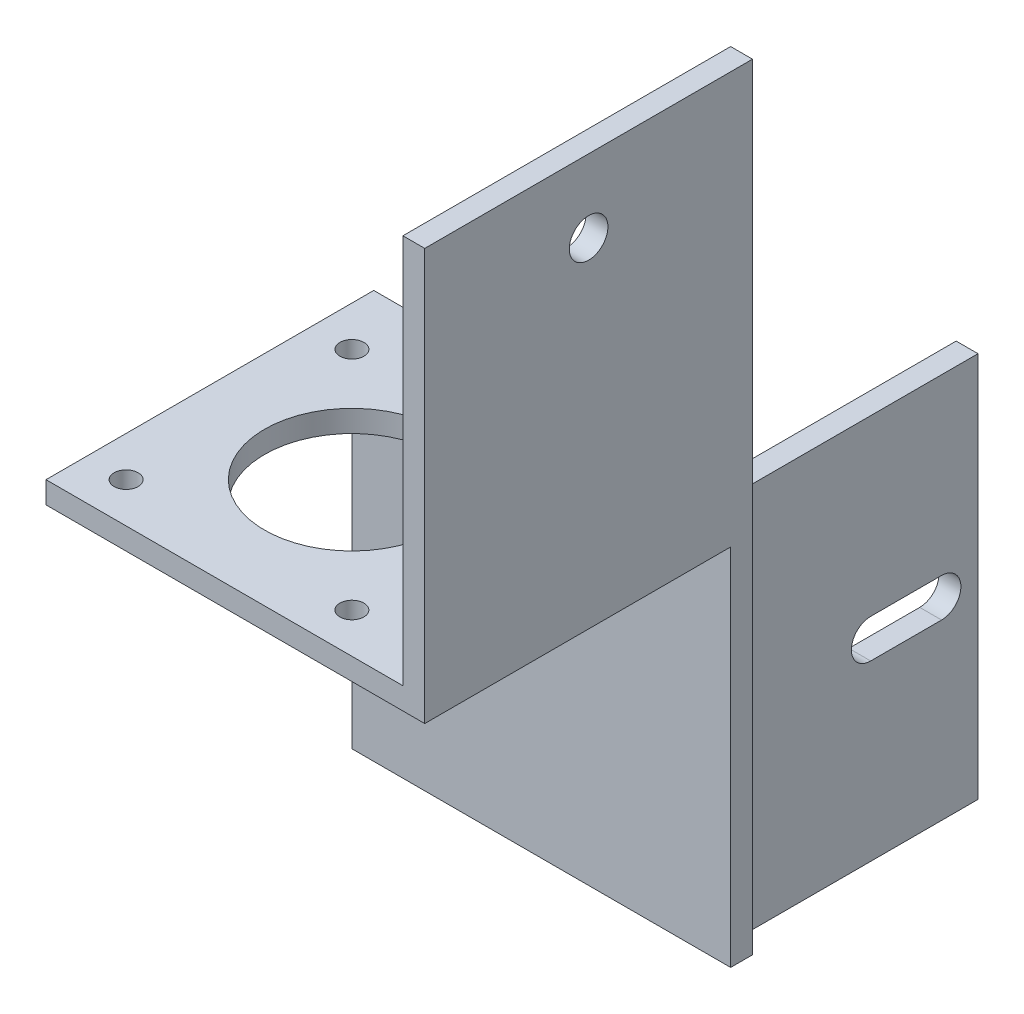
ISO-10303-21;
HEADER;
FILE_DESCRIPTION(('STEP AP214'),'2;1');
FILE_NAME('part.step','',(''),(''),'','','');
FILE_SCHEMA(('AUTOMOTIVE_DESIGN { 1 0 10303 214 1 1 1 1 }'));
ENDSEC;
DATA;
#1=APPLICATION_CONTEXT('core data for automotive mechanical design processes');
#2=APPLICATION_PROTOCOL_DEFINITION('international standard','automotive_design',2000,#1);
#3=PRODUCT_CONTEXT('',#1,'mechanical');
#4=PRODUCT('Part','Part','',(#3));
#5=PRODUCT_RELATED_PRODUCT_CATEGORY('part','',(#4));
#6=PRODUCT_DEFINITION_FORMATION('','',#4);
#7=PRODUCT_DEFINITION_CONTEXT('part definition',#1,'design');
#8=PRODUCT_DEFINITION('design','',#6,#7);
#9=PRODUCT_DEFINITION_SHAPE('','',#8);
#10=(LENGTH_UNIT() NAMED_UNIT(*) SI_UNIT(.MILLI.,.METRE.));
#11=(NAMED_UNIT(*) PLANE_ANGLE_UNIT() SI_UNIT($,.RADIAN.));
#12=(NAMED_UNIT(*) SI_UNIT($,.STERADIAN.) SOLID_ANGLE_UNIT());
#13=UNCERTAINTY_MEASURE_WITH_UNIT(LENGTH_MEASURE(1.E-05),#10,'distance_accuracy_value','');
#14=(GEOMETRIC_REPRESENTATION_CONTEXT(3) GLOBAL_UNCERTAINTY_ASSIGNED_CONTEXT((#13)) GLOBAL_UNIT_ASSIGNED_CONTEXT((#10,
#11,#12)) REPRESENTATION_CONTEXT('',''));
#15=CARTESIAN_POINT('',(0.,0.,0.));
#16=DIRECTION('',(0.,0.,1.));
#17=DIRECTION('',(1.,0.,0.));
#18=AXIS2_PLACEMENT_3D('',#15,#16,#17);
#19=CARTESIAN_POINT('',(0.,0.,0.));
#20=DIRECTION('',(0.,0.,1.));
#21=DIRECTION('',(1.,0.,0.));
#22=AXIS2_PLACEMENT_3D('',#19,#20,#21);
#23=PLANE('',#22);
#24=DIRECTION('',(0.,-1.,0.));
#25=VECTOR('',#24,1.);
#26=CARTESIAN_POINT('',(30.8060344827586,-41.6400862068965,0.));
#27=LINE('',#26,#25);
#28=CARTESIAN_POINT('',(30.8060344827586,11.3599137931034,0.));
#29=VERTEX_POINT('',#28);
#30=CARTESIAN_POINT('',(30.8060344827586,-41.6400862068965,0.));
#31=VERTEX_POINT('',#30);
#32=EDGE_CURVE('E175',#29,#31,#27,.T.);
#33=ORIENTED_EDGE('',*,*,#32,.F.);
#34=DIRECTION('',(0.,-1.,0.));
#35=VECTOR('',#34,1.);
#36=CARTESIAN_POINT('',(30.8060344827586,64.8599137931034,0.));
#37=LINE('',#36,#35);
#38=CARTESIAN_POINT('',(30.8060344827586,64.8599137931034,0.));
#39=VERTEX_POINT('',#38);
#40=EDGE_CURVE('E224',#39,#29,#37,.T.);
#41=ORIENTED_EDGE('',*,*,#40,.F.);
#42=DIRECTION('',(-1.,0.,0.));
#43=VECTOR('',#42,1.);
#44=CARTESIAN_POINT('',(33.8060344827586,64.8599137931034,0.));
#45=LINE('',#44,#43);
#46=CARTESIAN_POINT('',(33.8060344827586,64.8599137931034,0.));
#47=VERTEX_POINT('',#46);
#48=EDGE_CURVE('E211',#47,#39,#45,.T.);
#49=ORIENTED_EDGE('',*,*,#48,.F.);
#50=DIRECTION('',(0.,1.,0.));
#51=VECTOR('',#50,1.);
#52=CARTESIAN_POINT('',(33.8060344827586,-41.6400862068965,0.));
#53=LINE('',#52,#51);
#54=CARTESIAN_POINT('',(33.8060344827586,-41.6400862068965,0.));
#55=VERTEX_POINT('',#54);
#56=EDGE_CURVE('E239',#55,#47,#53,.T.);
#57=ORIENTED_EDGE('',*,*,#56,.F.);
#58=DIRECTION('',(1.,0.,0.));
#59=VECTOR('',#58,1.);
#60=CARTESIAN_POINT('',(-18.1939655172414,-41.6400862068965,0.));
#61=LINE('',#60,#59);
#62=EDGE_CURVE('E292',#31,#55,#61,.T.);
#63=ORIENTED_EDGE('',*,*,#62,.F.);
#64=EDGE_LOOP('',(#33,#41,#49,#57,#63));
#65=FACE_BOUND('',#64,.T.);
#66=ADVANCED_FACE('F39',(#65),#23,.F.);
#67=DIRECTION('',(0.,1.,0.));
#68=VECTOR('',#67,1.);
#69=CARTESIAN_POINT('',(27.8060344827586,-41.6400862068965,0.));
#70=LINE('',#69,#68);
#71=CARTESIAN_POINT('',(27.8060344827586,-41.6400862068965,0.));
#72=VERTEX_POINT('',#71);
#73=CARTESIAN_POINT('',(27.8060344827586,11.3599137931034,0.));
#74=VERTEX_POINT('',#73);
#75=EDGE_CURVE('E182',#72,#74,#70,.T.);
#76=ORIENTED_EDGE('',*,*,#75,.F.);
#77=CARTESIAN_POINT('',(-18.1939655172414,-41.6400862068965,0.));
#78=VERTEX_POINT('',#77);
#79=EDGE_CURVE('E293',#78,#72,#61,.T.);
#80=ORIENTED_EDGE('',*,*,#79,.F.);
#81=DIRECTION('',(0.,-1.,0.));
#82=VECTOR('',#81,1.);
#83=CARTESIAN_POINT('',(-18.1939655172414,11.3599137931034,0.));
#84=LINE('',#83,#82);
#85=CARTESIAN_POINT('',(-18.1939655172414,11.3599137931034,0.));
#86=VERTEX_POINT('',#85);
#87=EDGE_CURVE('E283',#86,#78,#84,.T.);
#88=ORIENTED_EDGE('',*,*,#87,.F.);
#89=DIRECTION('',(-1.,0.,0.));
#90=VECTOR('',#89,1.);
#91=CARTESIAN_POINT('',(-18.1939655172414,11.3599137931034,0.));
#92=LINE('',#91,#90);
#93=EDGE_CURVE('E287',#74,#86,#92,.T.);
#94=ORIENTED_EDGE('',*,*,#93,.F.);
#95=EDGE_LOOP('',(#76,#80,#88,#94));
#96=FACE_BOUND('',#95,.T.);
#97=ADVANCED_FACE('F327',(#96),#23,.F.);
#98=CARTESIAN_POINT('',(-18.1939655172414,11.3599137931034,3.));
#99=DIRECTION('',(0.,-1.,0.));
#100=DIRECTION('',(0.,0.,-1.));
#101=AXIS2_PLACEMENT_3D('',#98,#99,#100);
#102=PLANE('',#101);
#103=CARTESIAN_POINT('',(2.80603448275863,11.3599137931034,24.));
#104=DIRECTION('',(0.,-1.,0.));
#105=DIRECTION('',(0.,0.,-1.));
#106=AXIS2_PLACEMENT_3D('',#103,#104,#105);
#107=CIRCLE('',#106,12.);
#108=CARTESIAN_POINT('',(2.80603448275863,11.3599137931034,12.));
#109=VERTEX_POINT('',#108);
#110=EDGE_CURVE('E266',#109,#109,#107,.T.);
#111=ORIENTED_EDGE('',*,*,#110,.T.);
#112=EDGE_LOOP('',(#111));
#113=FACE_BOUND('',#112,.T.);
#114=CARTESIAN_POINT('',(18.3060344827586,11.3599137931034,39.5));
#115=DIRECTION('',(0.,-1.,0.));
#116=DIRECTION('',(0.,0.,-1.));
#117=AXIS2_PLACEMENT_3D('',#114,#115,#116);
#118=CIRCLE('',#117,1.65);
#119=CARTESIAN_POINT('',(18.3060344827586,11.3599137931034,37.85));
#120=VERTEX_POINT('',#119);
#121=EDGE_CURVE('E242',#120,#120,#118,.T.);
#122=ORIENTED_EDGE('',*,*,#121,.T.);
#123=EDGE_LOOP('',(#122));
#124=FACE_BOUND('',#123,.T.);
#125=CARTESIAN_POINT('',(18.306034482759,11.3599137931034,8.49999999999994));
#126=DIRECTION('',(0.,-1.,0.));
#127=DIRECTION('',(0.,0.,-1.));
#128=AXIS2_PLACEMENT_3D('',#125,#126,#127);
#129=CIRCLE('',#128,1.65);
#130=CARTESIAN_POINT('',(18.306034482759,11.3599137931034,6.84999999999995));
#131=VERTEX_POINT('',#130);
#132=EDGE_CURVE('E249',#131,#131,#129,.T.);
#133=ORIENTED_EDGE('',*,*,#132,.T.);
#134=EDGE_LOOP('',(#133));
#135=FACE_BOUND('',#134,.T.);
#136=CARTESIAN_POINT('',(-12.6939655172411,11.3599137931034,8.49999999999968));
#137=DIRECTION('',(0.,-1.,0.));
#138=DIRECTION('',(0.,0.,-1.));
#139=AXIS2_PLACEMENT_3D('',#136,#137,#138);
#140=CIRCLE('',#139,1.64999999999999);
#141=CARTESIAN_POINT('',(-12.6939655172411,11.3599137931034,6.84999999999969));
#142=VERTEX_POINT('',#141);
#143=EDGE_CURVE('E255',#142,#142,#140,.T.);
#144=ORIENTED_EDGE('',*,*,#143,.T.);
#145=EDGE_LOOP('',(#144));
#146=FACE_BOUND('',#145,.T.);
#147=CARTESIAN_POINT('',(-12.6939655172412,11.3599137931034,39.4999999999997));
#148=DIRECTION('',(0.,-1.,0.));
#149=DIRECTION('',(0.,0.,-1.));
#150=AXIS2_PLACEMENT_3D('',#147,#148,#149);
#151=CIRCLE('',#150,1.65);
#152=CARTESIAN_POINT('',(-12.6939655172412,11.3599137931034,37.8499999999997));
#153=VERTEX_POINT('',#152);
#154=EDGE_CURVE('E261',#153,#153,#151,.T.);
#155=ORIENTED_EDGE('',*,*,#154,.T.);
#156=EDGE_LOOP('',(#155));
#157=FACE_BOUND('',#156,.T.);
#158=DIRECTION('',(0.,0.,1.));
#159=VECTOR('',#158,1.);
#160=CARTESIAN_POINT('',(30.8060344827586,11.3599137931034,0.));
#161=LINE('',#160,#159);
#162=CARTESIAN_POINT('',(30.8060344827586,11.3599137931034,45.));
#163=VERTEX_POINT('',#162);
#164=EDGE_CURVE('E212',#29,#163,#161,.T.);
#165=ORIENTED_EDGE('',*,*,#164,.F.);
#166=DIRECTION('',(0.,0.,1.));
#167=VECTOR('',#166,1.);
#168=CARTESIAN_POINT('',(30.8060344827586,11.3599137931034,-33.96));
#169=LINE('',#168,#167);
#170=CARTESIAN_POINT('',(30.8060344827586,11.3599137931034,-33.96));
#171=VERTEX_POINT('',#170);
#172=EDGE_CURVE('E188',#171,#29,#169,.T.);
#173=ORIENTED_EDGE('',*,*,#172,.F.);
#174=DIRECTION('',(1.,0.,0.));
#175=VECTOR('',#174,1.);
#176=CARTESIAN_POINT('',(30.8060344827586,11.3599137931034,-33.96));
#177=LINE('',#176,#175);
#178=CARTESIAN_POINT('',(27.8060344827586,11.3599137931034,-33.96));
#179=VERTEX_POINT('',#178);
#180=EDGE_CURVE('E186',#179,#171,#177,.T.);
#181=ORIENTED_EDGE('',*,*,#180,.F.);
#182=DIRECTION('',(0.,0.,1.));
#183=VECTOR('',#182,1.);
#184=CARTESIAN_POINT('',(27.8060344827586,11.3599137931034,-33.96));
#185=LINE('',#184,#183);
#186=EDGE_CURVE('E195',#179,#74,#185,.T.);
#187=ORIENTED_EDGE('',*,*,#186,.T.);
#188=ORIENTED_EDGE('',*,*,#93,.T.);
#189=DIRECTION('',(0.,0.,-1.));
#190=VECTOR('',#189,1.);
#191=CARTESIAN_POINT('',(-18.1939655172414,11.3599137931034,3.));
#192=LINE('',#191,#190);
#193=CARTESIAN_POINT('',(-18.1939655172414,11.3599137931034,45.));
#194=VERTEX_POINT('',#193);
#195=EDGE_CURVE('E289',#194,#86,#192,.T.);
#196=ORIENTED_EDGE('',*,*,#195,.F.);
#197=DIRECTION('',(-1.,0.,0.));
#198=VECTOR('',#197,1.);
#199=CARTESIAN_POINT('',(-18.1939655172414,11.3599137931034,45.));
#200=LINE('',#199,#198);
#201=EDGE_CURVE('E277',#163,#194,#200,.T.);
#202=ORIENTED_EDGE('',*,*,#201,.F.);
#203=EDGE_LOOP('',(#165,#173,#181,#187,#188,#196,#202));
#204=FACE_BOUND('',#203,.T.);
#205=ADVANCED_FACE('F334',(#113,#124,#135,#146,#157,#204),#102,.F.);
#206=CARTESIAN_POINT('',(-18.1939655172414,11.3599137931034,3.));
#207=DIRECTION('',(1.,0.,0.));
#208=DIRECTION('',(0.,1.,0.));
#209=AXIS2_PLACEMENT_3D('',#206,#207,#208);
#210=PLANE('',#209);
#211=ORIENTED_EDGE('',*,*,#87,.T.);
#212=DIRECTION('',(0.,0.,-1.));
#213=VECTOR('',#212,1.);
#214=CARTESIAN_POINT('',(-18.1939655172414,-41.6400862068965,3.));
#215=LINE('',#214,#213);
#216=CARTESIAN_POINT('',(-18.1939655172414,-41.6400862068965,3.));
#217=VERTEX_POINT('',#216);
#218=EDGE_CURVE('E299',#217,#78,#215,.T.);
#219=ORIENTED_EDGE('',*,*,#218,.F.);
#220=DIRECTION('',(0.,-1.,0.));
#221=VECTOR('',#220,1.);
#222=CARTESIAN_POINT('',(-18.1939655172414,11.3599137931034,3.));
#223=LINE('',#222,#221);
#224=CARTESIAN_POINT('',(-18.1939655172414,8.35991379310345,3.));
#225=VERTEX_POINT('',#224);
#226=EDGE_CURVE('E284',#225,#217,#223,.T.);
#227=ORIENTED_EDGE('',*,*,#226,.F.);
#228=DIRECTION('',(0.,0.,-1.));
#229=VECTOR('',#228,1.);
#230=CARTESIAN_POINT('',(-18.1939655172414,8.35991379310345,45.));
#231=LINE('',#230,#229);
#232=CARTESIAN_POINT('',(-18.1939655172414,8.35991379310345,45.));
#233=VERTEX_POINT('',#232);
#234=EDGE_CURVE('E279',#233,#225,#231,.T.);
#235=ORIENTED_EDGE('',*,*,#234,.F.);
#236=DIRECTION('',(0.,-1.,0.));
#237=VECTOR('',#236,1.);
#238=CARTESIAN_POINT('',(-18.1939655172414,11.3599137931034,45.));
#239=LINE('',#238,#237);
#240=EDGE_CURVE('E272',#194,#233,#239,.T.);
#241=ORIENTED_EDGE('',*,*,#240,.F.);
#242=ORIENTED_EDGE('',*,*,#195,.T.);
#243=EDGE_LOOP('',(#211,#219,#227,#235,#241,#242));
#244=FACE_BOUND('',#243,.T.);
#245=ADVANCED_FACE('F41',(#244),#210,.F.);
#246=CARTESIAN_POINT('',(-18.1939655172414,-41.6400862068965,3.));
#247=DIRECTION('',(0.,1.,0.));
#248=DIRECTION('',(0.,0.,1.));
#249=AXIS2_PLACEMENT_3D('',#246,#247,#248);
#250=PLANE('',#249);
#251=ORIENTED_EDGE('',*,*,#79,.T.);
#252=DIRECTION('',(0.,0.,1.));
#253=VECTOR('',#252,1.);
#254=CARTESIAN_POINT('',(27.8060344827586,-41.6400862068965,-33.96));
#255=LINE('',#254,#253);
#256=CARTESIAN_POINT('',(27.8060344827586,-41.6400862068965,-33.96));
#257=VERTEX_POINT('',#256);
#258=EDGE_CURVE('E198',#257,#72,#255,.T.);
#259=ORIENTED_EDGE('',*,*,#258,.F.);
#260=DIRECTION('',(-1.,0.,0.));
#261=VECTOR('',#260,1.);
#262=CARTESIAN_POINT('',(30.8060344827586,-41.6400862068965,-33.96));
#263=LINE('',#262,#261);
#264=CARTESIAN_POINT('',(30.8060344827586,-41.6400862068965,-33.96));
#265=VERTEX_POINT('',#264);
#266=EDGE_CURVE('E181',#265,#257,#263,.T.);
#267=ORIENTED_EDGE('',*,*,#266,.F.);
#268=DIRECTION('',(0.,0.,1.));
#269=VECTOR('',#268,1.);
#270=CARTESIAN_POINT('',(30.8060344827586,-41.6400862068965,-33.96));
#271=LINE('',#270,#269);
#272=EDGE_CURVE('E201',#265,#31,#271,.T.);
#273=ORIENTED_EDGE('',*,*,#272,.T.);
#274=ORIENTED_EDGE('',*,*,#62,.T.);
#275=DIRECTION('',(0.,0.,-1.));
#276=VECTOR('',#275,1.);
#277=CARTESIAN_POINT('',(33.8060344827586,-41.6400862068965,0.));
#278=LINE('',#277,#276);
#279=CARTESIAN_POINT('',(33.8060344827586,-41.6400862068965,3.));
#280=VERTEX_POINT('',#279);
#281=EDGE_CURVE('E236',#280,#55,#278,.T.);
#282=ORIENTED_EDGE('',*,*,#281,.F.);
#283=DIRECTION('',(1.,0.,0.));
#284=VECTOR('',#283,1.);
#285=CARTESIAN_POINT('',(-18.1939655172414,-41.6400862068965,3.));
#286=LINE('',#285,#284);
#287=EDGE_CURVE('E286',#217,#280,#286,.T.);
#288=ORIENTED_EDGE('',*,*,#287,.F.);
#289=ORIENTED_EDGE('',*,*,#218,.T.);
#290=EDGE_LOOP('',(#251,#259,#267,#273,#274,#282,#288,#289));
#291=FACE_BOUND('',#290,.T.);
#292=ADVANCED_FACE('F342',(#291),#250,.F.);
#293=CARTESIAN_POINT('',(0.,0.,3.));
#294=DIRECTION('',(0.,0.,1.));
#295=DIRECTION('',(1.,0.,0.));
#296=AXIS2_PLACEMENT_3D('',#293,#294,#295);
#297=PLANE('',#296);
#298=DIRECTION('',(1.,0.,0.));
#299=VECTOR('',#298,1.);
#300=CARTESIAN_POINT('',(-18.1939655172414,8.35991379310345,3.));
#301=LINE('',#300,#299);
#302=CARTESIAN_POINT('',(33.8060344827586,8.35991379310345,3.));
#303=VERTEX_POINT('',#302);
#304=EDGE_CURVE('E269',#225,#303,#301,.T.);
#305=ORIENTED_EDGE('',*,*,#304,.F.);
#306=ORIENTED_EDGE('',*,*,#226,.T.);
#307=ORIENTED_EDGE('',*,*,#287,.T.);
#308=DIRECTION('',(0.,-1.,0.));
#309=VECTOR('',#308,1.);
#310=CARTESIAN_POINT('',(33.8060344827586,-41.6400862068965,3.));
#311=LINE('',#310,#309);
#312=EDGE_CURVE('E233',#303,#280,#311,.T.);
#313=ORIENTED_EDGE('',*,*,#312,.F.);
#314=EDGE_LOOP('',(#305,#306,#307,#313));
#315=FACE_BOUND('',#314,.T.);
#316=ADVANCED_FACE('F338',(#315),#297,.T.);
#317=CARTESIAN_POINT('',(-18.1939655172414,8.35991379310345,45.));
#318=DIRECTION('',(0.,1.,0.));
#319=DIRECTION('',(0.,0.,1.));
#320=AXIS2_PLACEMENT_3D('',#317,#318,#319);
#321=PLANE('',#320);
#322=CARTESIAN_POINT('',(-12.6939655172412,8.35991379310345,39.4999999999997));
#323=DIRECTION('',(0.,-1.,0.));
#324=DIRECTION('',(0.,0.,-1.));
#325=AXIS2_PLACEMENT_3D('',#322,#323,#324);
#326=CIRCLE('',#325,1.65);
#327=CARTESIAN_POINT('',(-12.6939655172412,8.35991379310345,37.8499999999997));
#328=VERTEX_POINT('',#327);
#329=EDGE_CURVE('E241',#328,#328,#326,.T.);
#330=ORIENTED_EDGE('',*,*,#329,.F.);
#331=EDGE_LOOP('',(#330));
#332=FACE_BOUND('',#331,.T.);
#333=CARTESIAN_POINT('',(-12.6939655172411,8.35991379310345,8.49999999999968));
#334=DIRECTION('',(0.,-1.,0.));
#335=DIRECTION('',(0.,0.,-1.));
#336=AXIS2_PLACEMENT_3D('',#333,#334,#335);
#337=CIRCLE('',#336,1.64999999999999);
#338=CARTESIAN_POINT('',(-12.6939655172411,8.35991379310345,6.84999999999969));
#339=VERTEX_POINT('',#338);
#340=EDGE_CURVE('E258',#339,#339,#337,.T.);
#341=ORIENTED_EDGE('',*,*,#340,.F.);
#342=EDGE_LOOP('',(#341));
#343=FACE_BOUND('',#342,.T.);
#344=CARTESIAN_POINT('',(18.306034482759,8.35991379310345,8.49999999999994));
#345=DIRECTION('',(0.,-1.,0.));
#346=DIRECTION('',(0.,0.,-1.));
#347=AXIS2_PLACEMENT_3D('',#344,#345,#346);
#348=CIRCLE('',#347,1.65);
#349=CARTESIAN_POINT('',(18.306034482759,8.35991379310345,6.84999999999995));
#350=VERTEX_POINT('',#349);
#351=EDGE_CURVE('E252',#350,#350,#348,.T.);
#352=ORIENTED_EDGE('',*,*,#351,.F.);
#353=EDGE_LOOP('',(#352));
#354=FACE_BOUND('',#353,.T.);
#355=CARTESIAN_POINT('',(18.3060344827586,8.35991379310345,39.5));
#356=DIRECTION('',(0.,-1.,0.));
#357=DIRECTION('',(0.,0.,-1.));
#358=AXIS2_PLACEMENT_3D('',#355,#356,#357);
#359=CIRCLE('',#358,1.65);
#360=CARTESIAN_POINT('',(18.3060344827586,8.35991379310345,37.85));
#361=VERTEX_POINT('',#360);
#362=EDGE_CURVE('E246',#361,#361,#359,.T.);
#363=ORIENTED_EDGE('',*,*,#362,.F.);
#364=EDGE_LOOP('',(#363));
#365=FACE_BOUND('',#364,.T.);
#366=CARTESIAN_POINT('',(2.80603448275863,8.35991379310345,24.));
#367=DIRECTION('',(0.,-1.,0.));
#368=DIRECTION('',(0.,0.,-1.));
#369=AXIS2_PLACEMENT_3D('',#366,#367,#368);
#370=CIRCLE('',#369,12.);
#371=CARTESIAN_POINT('',(2.80603448275863,8.35991379310345,12.));
#372=VERTEX_POINT('',#371);
#373=EDGE_CURVE('E245',#372,#372,#370,.T.);
#374=ORIENTED_EDGE('',*,*,#373,.F.);
#375=EDGE_LOOP('',(#374));
#376=FACE_BOUND('',#375,.T.);
#377=ORIENTED_EDGE('',*,*,#304,.T.);
#378=DIRECTION('',(0.,0.,-1.));
#379=VECTOR('',#378,1.);
#380=CARTESIAN_POINT('',(33.8060344827586,8.35991379310345,45.));
#381=LINE('',#380,#379);
#382=CARTESIAN_POINT('',(33.8060344827586,8.35991379310345,45.));
#383=VERTEX_POINT('',#382);
#384=EDGE_CURVE('E230',#383,#303,#381,.T.);
#385=ORIENTED_EDGE('',*,*,#384,.F.);
#386=DIRECTION('',(1.,0.,0.));
#387=VECTOR('',#386,1.);
#388=CARTESIAN_POINT('',(-18.1939655172414,8.35991379310345,45.));
#389=LINE('',#388,#387);
#390=EDGE_CURVE('E275',#233,#383,#389,.T.);
#391=ORIENTED_EDGE('',*,*,#390,.F.);
#392=ORIENTED_EDGE('',*,*,#234,.T.);
#393=EDGE_LOOP('',(#377,#385,#391,#392));
#394=FACE_BOUND('',#393,.T.);
#395=ADVANCED_FACE('F349',(#332,#343,#354,#365,#376,#394),#321,.F.);
#396=CARTESIAN_POINT('',(0.,0.,45.));
#397=DIRECTION('',(0.,0.,1.));
#398=DIRECTION('',(1.,0.,0.));
#399=AXIS2_PLACEMENT_3D('',#396,#397,#398);
#400=PLANE('',#399);
#401=ORIENTED_EDGE('',*,*,#240,.T.);
#402=ORIENTED_EDGE('',*,*,#390,.T.);
#403=DIRECTION('',(0.,-1.,0.));
#404=VECTOR('',#403,1.);
#405=CARTESIAN_POINT('',(33.8060344827586,8.35991379310345,45.));
#406=LINE('',#405,#404);
#407=CARTESIAN_POINT('',(33.8060344827586,64.8599137931034,45.));
#408=VERTEX_POINT('',#407);
#409=EDGE_CURVE('E227',#408,#383,#406,.T.);
#410=ORIENTED_EDGE('',*,*,#409,.F.);
#411=DIRECTION('',(1.,0.,0.));
#412=VECTOR('',#411,1.);
#413=CARTESIAN_POINT('',(33.8060344827586,64.8599137931034,45.));
#414=LINE('',#413,#412);
#415=CARTESIAN_POINT('',(30.8060344827586,64.8599137931034,45.));
#416=VERTEX_POINT('',#415);
#417=EDGE_CURVE('E216',#416,#408,#414,.T.);
#418=ORIENTED_EDGE('',*,*,#417,.F.);
#419=DIRECTION('',(0.,-1.,0.));
#420=VECTOR('',#419,1.);
#421=CARTESIAN_POINT('',(30.8060344827586,64.8599137931034,45.));
#422=LINE('',#421,#420);
#423=EDGE_CURVE('E219',#416,#163,#422,.T.);
#424=ORIENTED_EDGE('',*,*,#423,.T.);
#425=ORIENTED_EDGE('',*,*,#201,.T.);
#426=EDGE_LOOP('',(#401,#402,#410,#418,#424,#425));
#427=FACE_BOUND('',#426,.T.);
#428=ADVANCED_FACE('F385',(#427),#400,.T.);
#429=CARTESIAN_POINT('',(2.80603448275863,11.3599137931034,24.));
#430=DIRECTION('',(0.,-1.,0.));
#431=DIRECTION('',(0.,0.,-1.));
#432=AXIS2_PLACEMENT_3D('',#429,#430,#431);
#433=CYLINDRICAL_SURFACE('',#432,12.);
#434=ORIENTED_EDGE('',*,*,#110,.F.);
#435=EDGE_LOOP('',(#434));
#436=FACE_BOUND('',#435,.T.);
#437=ORIENTED_EDGE('',*,*,#373,.T.);
#438=EDGE_LOOP('',(#437));
#439=FACE_BOUND('',#438,.T.);
#440=ADVANCED_FACE('F393',(#436,#439),#433,.F.);
#441=CARTESIAN_POINT('',(18.3060344827586,11.3599137931034,39.5));
#442=DIRECTION('',(0.,-1.,0.));
#443=DIRECTION('',(0.,0.,-1.));
#444=AXIS2_PLACEMENT_3D('',#441,#442,#443);
#445=CYLINDRICAL_SURFACE('',#444,1.65);
#446=ORIENTED_EDGE('',*,*,#121,.F.);
#447=EDGE_LOOP('',(#446));
#448=FACE_BOUND('',#447,.T.);
#449=ORIENTED_EDGE('',*,*,#362,.T.);
#450=EDGE_LOOP('',(#449));
#451=FACE_BOUND('',#450,.T.);
#452=ADVANCED_FACE('F400',(#448,#451),#445,.F.);
#453=CARTESIAN_POINT('',(18.306034482759,11.3599137931034,8.49999999999994));
#454=DIRECTION('',(0.,-1.,0.));
#455=DIRECTION('',(0.,0.,-1.));
#456=AXIS2_PLACEMENT_3D('',#453,#454,#455);
#457=CYLINDRICAL_SURFACE('',#456,1.65);
#458=ORIENTED_EDGE('',*,*,#132,.F.);
#459=EDGE_LOOP('',(#458));
#460=FACE_BOUND('',#459,.T.);
#461=ORIENTED_EDGE('',*,*,#351,.T.);
#462=EDGE_LOOP('',(#461));
#463=FACE_BOUND('',#462,.T.);
#464=ADVANCED_FACE('F409',(#460,#463),#457,.F.);
#465=CARTESIAN_POINT('',(-12.6939655172411,11.3599137931034,8.49999999999968));
#466=DIRECTION('',(0.,-1.,0.));
#467=DIRECTION('',(0.,0.,-1.));
#468=AXIS2_PLACEMENT_3D('',#465,#466,#467);
#469=CYLINDRICAL_SURFACE('',#468,1.64999999999999);
#470=ORIENTED_EDGE('',*,*,#143,.F.);
#471=EDGE_LOOP('',(#470));
#472=FACE_BOUND('',#471,.T.);
#473=ORIENTED_EDGE('',*,*,#340,.T.);
#474=EDGE_LOOP('',(#473));
#475=FACE_BOUND('',#474,.T.);
#476=ADVANCED_FACE('F405',(#472,#475),#469,.F.);
#477=CARTESIAN_POINT('',(-12.6939655172412,11.3599137931034,39.4999999999997));
#478=DIRECTION('',(0.,-1.,0.));
#479=DIRECTION('',(0.,0.,-1.));
#480=AXIS2_PLACEMENT_3D('',#477,#478,#479);
#481=CYLINDRICAL_SURFACE('',#480,1.65);
#482=ORIENTED_EDGE('',*,*,#154,.F.);
#483=EDGE_LOOP('',(#482));
#484=FACE_BOUND('',#483,.T.);
#485=ORIENTED_EDGE('',*,*,#329,.T.);
#486=EDGE_LOOP('',(#485));
#487=FACE_BOUND('',#486,.T.);
#488=ADVANCED_FACE('F402',(#484,#487),#481,.F.);
#489=CARTESIAN_POINT('',(33.8060344827586,0.,0.));
#490=DIRECTION('',(-1.,0.,0.));
#491=DIRECTION('',(0.,0.,1.));
#492=AXIS2_PLACEMENT_3D('',#489,#490,#491);
#493=PLANE('',#492);
#494=CARTESIAN_POINT('',(33.8060344827586,54.8599137931034,22.5));
#495=DIRECTION('',(1.,0.,0.));
#496=DIRECTION('',(0.,0.,-1.));
#497=AXIS2_PLACEMENT_3D('',#494,#495,#496);
#498=CIRCLE('',#497,2.65);
#499=CARTESIAN_POINT('',(33.8060344827586,54.8599137931034,19.85));
#500=VERTEX_POINT('',#499);
#501=EDGE_CURVE('E204',#500,#500,#498,.T.);
#502=ORIENTED_EDGE('',*,*,#501,.F.);
#503=EDGE_LOOP('',(#502));
#504=FACE_BOUND('',#503,.T.);
#505=ORIENTED_EDGE('',*,*,#409,.T.);
#506=ORIENTED_EDGE('',*,*,#384,.T.);
#507=ORIENTED_EDGE('',*,*,#312,.T.);
#508=ORIENTED_EDGE('',*,*,#281,.T.);
#509=ORIENTED_EDGE('',*,*,#56,.T.);
#510=DIRECTION('',(0.,0.,-1.));
#511=VECTOR('',#510,1.);
#512=CARTESIAN_POINT('',(33.8060344827586,64.8599137931034,0.));
#513=LINE('',#512,#511);
#514=EDGE_CURVE('E208',#408,#47,#513,.T.);
#515=ORIENTED_EDGE('',*,*,#514,.F.);
#516=EDGE_LOOP('',(#505,#506,#507,#508,#509,#515));
#517=FACE_BOUND('',#516,.T.);
#518=ADVANCED_FACE('F379',(#504,#517),#493,.F.);
#519=CARTESIAN_POINT('',(30.8060344827586,64.8599137931034,0.));
#520=DIRECTION('',(1.,0.,0.));
#521=DIRECTION('',(0.,0.,-1.));
#522=AXIS2_PLACEMENT_3D('',#519,#520,#521);
#523=PLANE('',#522);
#524=CARTESIAN_POINT('',(30.8060344827586,54.8599137931034,22.5));
#525=DIRECTION('',(1.,0.,0.));
#526=DIRECTION('',(0.,0.,-1.));
#527=AXIS2_PLACEMENT_3D('',#524,#525,#526);
#528=CIRCLE('',#527,2.65);
#529=CARTESIAN_POINT('',(30.8060344827586,54.8599137931034,19.85));
#530=VERTEX_POINT('',#529);
#531=EDGE_CURVE('E207',#530,#530,#528,.T.);
#532=ORIENTED_EDGE('',*,*,#531,.T.);
#533=EDGE_LOOP('',(#532));
#534=FACE_BOUND('',#533,.T.);
#535=ORIENTED_EDGE('',*,*,#164,.T.);
#536=ORIENTED_EDGE('',*,*,#423,.F.);
#537=DIRECTION('',(0.,0.,1.));
#538=VECTOR('',#537,1.);
#539=CARTESIAN_POINT('',(30.8060344827586,64.8599137931034,0.));
#540=LINE('',#539,#538);
#541=EDGE_CURVE('E214',#39,#416,#540,.T.);
#542=ORIENTED_EDGE('',*,*,#541,.F.);
#543=ORIENTED_EDGE('',*,*,#40,.T.);
#544=EDGE_LOOP('',(#535,#536,#542,#543));
#545=FACE_BOUND('',#544,.T.);
#546=ADVANCED_FACE('F373',(#534,#545),#523,.F.);
#547=CARTESIAN_POINT('',(0.,64.8599137931034,0.));
#548=DIRECTION('',(0.,-1.,0.));
#549=DIRECTION('',(0.,0.,-1.));
#550=AXIS2_PLACEMENT_3D('',#547,#548,#549);
#551=PLANE('',#550);
#552=ORIENTED_EDGE('',*,*,#514,.T.);
#553=ORIENTED_EDGE('',*,*,#48,.T.);
#554=ORIENTED_EDGE('',*,*,#541,.T.);
#555=ORIENTED_EDGE('',*,*,#417,.T.);
#556=EDGE_LOOP('',(#552,#553,#554,#555));
#557=FACE_BOUND('',#556,.T.);
#558=ADVANCED_FACE('F376',(#557),#551,.F.);
#559=CARTESIAN_POINT('',(13.8060344827586,54.8599137931034,22.5));
#560=DIRECTION('',(1.,0.,0.));
#561=DIRECTION('',(0.,0.,-1.));
#562=AXIS2_PLACEMENT_3D('',#559,#560,#561);
#563=CYLINDRICAL_SURFACE('',#562,2.65);
#564=ORIENTED_EDGE('',*,*,#501,.T.);
#565=EDGE_LOOP('',(#564));
#566=FACE_BOUND('',#565,.T.);
#567=ORIENTED_EDGE('',*,*,#531,.F.);
#568=EDGE_LOOP('',(#567));
#569=FACE_BOUND('',#568,.T.);
#570=ADVANCED_FACE('F424',(#566,#569),#563,.F.);
#571=CARTESIAN_POINT('',(30.8060344827586,-41.6400862068965,-33.96));
#572=DIRECTION('',(-1.,0.,0.));
#573=DIRECTION('',(0.,-1.,0.));
#574=AXIS2_PLACEMENT_3D('',#571,#572,#573);
#575=PLANE('',#574);
#576=DIRECTION('',(0.,0.,1.));
#577=VECTOR('',#576,1.);
#578=CARTESIAN_POINT('',(30.8060344827586,-12.507711284533,-28.96));
#579=LINE('',#578,#577);
#580=CARTESIAN_POINT('',(30.8060344827586,-12.507711284533,-28.96));
#581=VERTEX_POINT('',#580);
#582=CARTESIAN_POINT('',(30.8060344827586,-12.507711284533,-19.2248762227386));
#583=VERTEX_POINT('',#582);
#584=EDGE_CURVE('E161',#581,#583,#579,.T.);
#585=ORIENTED_EDGE('',*,*,#584,.F.);
#586=CARTESIAN_POINT('',(30.8060344827586,-15.157711284533,-28.96));
#587=DIRECTION('',(1.,0.,0.));
#588=DIRECTION('',(0.,1.,0.));
#589=AXIS2_PLACEMENT_3D('',#586,#587,#588);
#590=CIRCLE('',#589,2.65);
#591=CARTESIAN_POINT('',(30.8060344827586,-17.8077112845329,-28.96));
#592=VERTEX_POINT('',#591);
#593=EDGE_CURVE('E54',#592,#581,#590,.T.);
#594=ORIENTED_EDGE('',*,*,#593,.F.);
#595=DIRECTION('',(0.,0.,-1.));
#596=VECTOR('',#595,1.);
#597=CARTESIAN_POINT('',(30.8060344827586,-17.8077112845329,-28.96));
#598=LINE('',#597,#596);
#599=CARTESIAN_POINT('',(30.8060344827586,-17.8077112845329,-19.2248762227386));
#600=VERTEX_POINT('',#599);
#601=EDGE_CURVE('E168',#600,#592,#598,.T.);
#602=ORIENTED_EDGE('',*,*,#601,.F.);
#603=CARTESIAN_POINT('',(30.8060344827586,-15.157711284533,-19.2248762227386));
#604=DIRECTION('',(1.,0.,0.));
#605=DIRECTION('',(0.,1.,0.));
#606=AXIS2_PLACEMENT_3D('',#603,#604,#605);
#607=CIRCLE('',#606,2.65);
#608=EDGE_CURVE('E152',#583,#600,#607,.T.);
#609=ORIENTED_EDGE('',*,*,#608,.F.);
#610=EDGE_LOOP('',(#585,#594,#602,#609));
#611=FACE_BOUND('',#610,.T.);
#612=ORIENTED_EDGE('',*,*,#32,.T.);
#613=ORIENTED_EDGE('',*,*,#272,.F.);
#614=DIRECTION('',(0.,-1.,0.));
#615=VECTOR('',#614,1.);
#616=CARTESIAN_POINT('',(30.8060344827586,-41.6400862068965,-33.96));
#617=LINE('',#616,#615);
#618=EDGE_CURVE('E178',#171,#265,#617,.T.);
#619=ORIENTED_EDGE('',*,*,#618,.F.);
#620=ORIENTED_EDGE('',*,*,#172,.T.);
#621=EDGE_LOOP('',(#612,#613,#619,#620));
#622=FACE_BOUND('',#621,.T.);
#623=ADVANCED_FACE('F165',(#611,#622),#575,.F.);
#624=CARTESIAN_POINT('',(27.8060344827586,-41.6400862068965,-33.96));
#625=DIRECTION('',(1.,0.,0.));
#626=DIRECTION('',(0.,0.,-1.));
#627=AXIS2_PLACEMENT_3D('',#624,#625,#626);
#628=PLANE('',#627);
#629=DIRECTION('',(0.,0.,-1.));
#630=VECTOR('',#629,1.);
#631=CARTESIAN_POINT('',(27.8060344827586,-17.8077112845329,-33.96));
#632=LINE('',#631,#630);
#633=CARTESIAN_POINT('',(27.8060344827586,-17.8077112845329,-19.2248762227386));
#634=VERTEX_POINT('',#633);
#635=CARTESIAN_POINT('',(27.8060344827586,-17.8077112845329,-28.96));
#636=VERTEX_POINT('',#635);
#637=EDGE_CURVE('E47',#634,#636,#632,.T.);
#638=ORIENTED_EDGE('',*,*,#637,.T.);
#639=CARTESIAN_POINT('',(27.8060344827586,-15.157711284533,-28.96));
#640=DIRECTION('',(1.,0.,0.));
#641=DIRECTION('',(0.,0.,-1.));
#642=AXIS2_PLACEMENT_3D('',#639,#640,#641);
#643=CIRCLE('',#642,2.65);
#644=CARTESIAN_POINT('',(27.8060344827586,-12.507711284533,-28.96));
#645=VERTEX_POINT('',#644);
#646=EDGE_CURVE('E11',#636,#645,#643,.T.);
#647=ORIENTED_EDGE('',*,*,#646,.T.);
#648=DIRECTION('',(0.,0.,1.));
#649=VECTOR('',#648,1.);
#650=CARTESIAN_POINT('',(27.8060344827586,-12.507711284533,-33.96));
#651=LINE('',#650,#649);
#652=CARTESIAN_POINT('',(27.8060344827586,-12.507711284533,-19.2248762227386));
#653=VERTEX_POINT('',#652);
#654=EDGE_CURVE('E302',#645,#653,#651,.T.);
#655=ORIENTED_EDGE('',*,*,#654,.T.);
#656=CARTESIAN_POINT('',(27.8060344827586,-15.157711284533,-19.2248762227386));
#657=DIRECTION('',(1.,0.,0.));
#658=DIRECTION('',(0.,0.,-1.));
#659=AXIS2_PLACEMENT_3D('',#656,#657,#658);
#660=CIRCLE('',#659,2.65);
#661=EDGE_CURVE('E155',#653,#634,#660,.T.);
#662=ORIENTED_EDGE('',*,*,#661,.T.);
#663=EDGE_LOOP('',(#638,#647,#655,#662));
#664=FACE_BOUND('',#663,.T.);
#665=ORIENTED_EDGE('',*,*,#75,.T.);
#666=ORIENTED_EDGE('',*,*,#186,.F.);
#667=DIRECTION('',(0.,1.,0.));
#668=VECTOR('',#667,1.);
#669=CARTESIAN_POINT('',(27.8060344827586,-41.6400862068965,-33.96));
#670=LINE('',#669,#668);
#671=EDGE_CURVE('E184',#257,#179,#670,.T.);
#672=ORIENTED_EDGE('',*,*,#671,.F.);
#673=ORIENTED_EDGE('',*,*,#258,.T.);
#674=EDGE_LOOP('',(#665,#666,#672,#673));
#675=FACE_BOUND('',#674,.T.);
#676=ADVANCED_FACE('F308',(#664,#675),#628,.F.);
#677=CARTESIAN_POINT('',(0.,0.,-33.96));
#678=DIRECTION('',(0.,0.,1.));
#679=DIRECTION('',(1.,0.,0.));
#680=AXIS2_PLACEMENT_3D('',#677,#678,#679);
#681=PLANE('',#680);
#682=ORIENTED_EDGE('',*,*,#618,.T.);
#683=ORIENTED_EDGE('',*,*,#266,.T.);
#684=ORIENTED_EDGE('',*,*,#671,.T.);
#685=ORIENTED_EDGE('',*,*,#180,.T.);
#686=EDGE_LOOP('',(#682,#683,#684,#685));
#687=FACE_BOUND('',#686,.T.);
#688=ADVANCED_FACE('F315',(#687),#681,.F.);
#689=CARTESIAN_POINT('',(-3.15396551724137,-15.157711284533,-28.96));
#690=DIRECTION('',(1.,0.,0.));
#691=DIRECTION('',(0.,1.,0.));
#692=AXIS2_PLACEMENT_3D('',#689,#690,#691);
#693=CYLINDRICAL_SURFACE('',#692,2.65);
#694=DIRECTION('',(1.,0.,0.));
#695=VECTOR('',#694,1.);
#696=CARTESIAN_POINT('',(-3.15396551724137,-17.807711284533,-28.96));
#697=LINE('',#696,#695);
#698=EDGE_CURVE('E173',#636,#592,#697,.T.);
#699=ORIENTED_EDGE('',*,*,#698,.T.);
#700=ORIENTED_EDGE('',*,*,#593,.T.);
#701=DIRECTION('',(1.,0.,0.));
#702=VECTOR('',#701,1.);
#703=CARTESIAN_POINT('',(-3.15396551724137,-12.507711284533,-28.96));
#704=LINE('',#703,#702);
#705=EDGE_CURVE('E158',#645,#581,#704,.T.);
#706=ORIENTED_EDGE('',*,*,#705,.F.);
#707=ORIENTED_EDGE('',*,*,#646,.F.);
#708=EDGE_LOOP('',(#699,#700,#706,#707));
#709=FACE_BOUND('',#708,.T.);
#710=ADVANCED_FACE('F313',(#709),#693,.F.);
#711=CARTESIAN_POINT('',(-3.15396551724137,-17.807711284533,-28.96));
#712=DIRECTION('',(0.,-1.,0.));
#713=DIRECTION('',(1.,0.,0.));
#714=AXIS2_PLACEMENT_3D('',#711,#712,#713);
#715=PLANE('',#714);
#716=DIRECTION('',(1.,0.,0.));
#717=VECTOR('',#716,1.);
#718=CARTESIAN_POINT('',(-3.15396551724137,-17.807711284533,-19.2248762227386));
#719=LINE('',#718,#717);
#720=EDGE_CURVE('E157',#634,#600,#719,.T.);
#721=ORIENTED_EDGE('',*,*,#720,.T.);
#722=ORIENTED_EDGE('',*,*,#601,.T.);
#723=ORIENTED_EDGE('',*,*,#698,.F.);
#724=ORIENTED_EDGE('',*,*,#637,.F.);
#725=EDGE_LOOP('',(#721,#722,#723,#724));
#726=FACE_BOUND('',#725,.T.);
#727=ADVANCED_FACE('F312',(#726),#715,.F.);
#728=CARTESIAN_POINT('',(-3.15396551724137,-15.157711284533,-19.2248762227386));
#729=DIRECTION('',(1.,0.,0.));
#730=DIRECTION('',(0.,1.,0.));
#731=AXIS2_PLACEMENT_3D('',#728,#729,#730);
#732=CYLINDRICAL_SURFACE('',#731,2.65);
#733=DIRECTION('',(1.,0.,0.));
#734=VECTOR('',#733,1.);
#735=CARTESIAN_POINT('',(-3.15396551724137,-12.507711284533,-19.2248762227386));
#736=LINE('',#735,#734);
#737=EDGE_CURVE('E62',#653,#583,#736,.T.);
#738=ORIENTED_EDGE('',*,*,#737,.T.);
#739=ORIENTED_EDGE('',*,*,#608,.T.);
#740=ORIENTED_EDGE('',*,*,#720,.F.);
#741=ORIENTED_EDGE('',*,*,#661,.F.);
#742=EDGE_LOOP('',(#738,#739,#740,#741));
#743=FACE_BOUND('',#742,.T.);
#744=ADVANCED_FACE('F149',(#743),#732,.F.);
#745=CARTESIAN_POINT('',(-3.15396551724137,-12.507711284533,-28.96));
#746=DIRECTION('',(0.,1.,0.));
#747=DIRECTION('',(0.,0.,1.));
#748=AXIS2_PLACEMENT_3D('',#745,#746,#747);
#749=PLANE('',#748);
#750=ORIENTED_EDGE('',*,*,#705,.T.);
#751=ORIENTED_EDGE('',*,*,#584,.T.);
#752=ORIENTED_EDGE('',*,*,#737,.F.);
#753=ORIENTED_EDGE('',*,*,#654,.F.);
#754=EDGE_LOOP('',(#750,#751,#752,#753));
#755=FACE_BOUND('',#754,.T.);
#756=ADVANCED_FACE('F162',(#755),#749,.F.);
#757=CLOSED_SHELL('',(#66,#97,#205,#245,#292,#316,#395,#428,#440,#452,#464,#476,#488,#518,#546,
#558,#570,#623,#676,#688,#710,#727,#744,#756));
#758=MANIFOLD_SOLID_BREP('B2',#757);
#759=ADVANCED_BREP_SHAPE_REPRESENTATION('',(#18,#758),#14);
#760=SHAPE_DEFINITION_REPRESENTATION(#9,#759);
ENDSEC;
END-ISO-10303-21;
